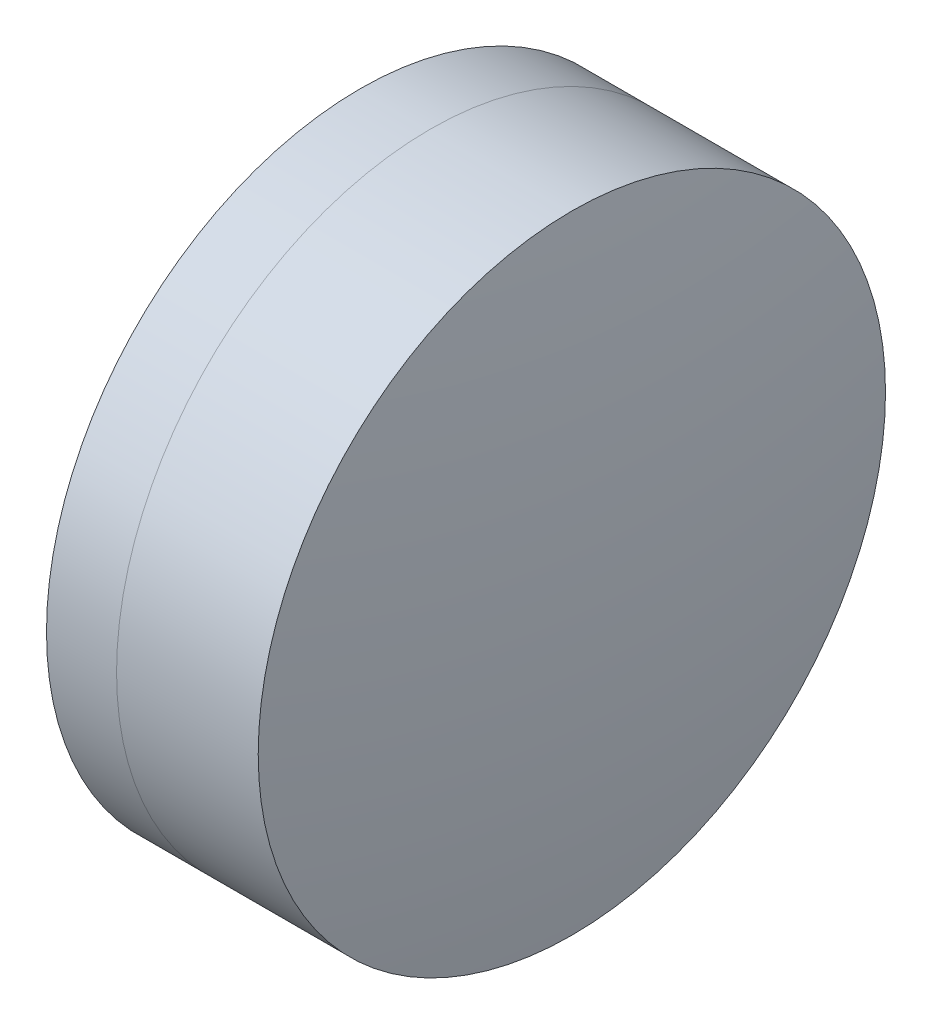
ISO-10303-21;
HEADER;
FILE_DESCRIPTION(('STEP AP214'),'2;1');
FILE_NAME('part.step','',(''),(''),'','','');
FILE_SCHEMA(('AUTOMOTIVE_DESIGN { 1 0 10303 214 1 1 1 1 }'));
ENDSEC;
DATA;
#1=APPLICATION_CONTEXT('core data for automotive mechanical design processes');
#2=APPLICATION_PROTOCOL_DEFINITION('international standard','automotive_design',2000,#1);
#3=PRODUCT_CONTEXT('',#1,'mechanical');
#4=PRODUCT('Part','Part','',(#3));
#5=PRODUCT_RELATED_PRODUCT_CATEGORY('part','',(#4));
#6=PRODUCT_DEFINITION_FORMATION('','',#4);
#7=PRODUCT_DEFINITION_CONTEXT('part definition',#1,'design');
#8=PRODUCT_DEFINITION('design','',#6,#7);
#9=PRODUCT_DEFINITION_SHAPE('','',#8);
#10=(LENGTH_UNIT() NAMED_UNIT(*) SI_UNIT(.MILLI.,.METRE.));
#11=(NAMED_UNIT(*) PLANE_ANGLE_UNIT() SI_UNIT($,.RADIAN.));
#12=(NAMED_UNIT(*) SI_UNIT($,.STERADIAN.) SOLID_ANGLE_UNIT());
#13=UNCERTAINTY_MEASURE_WITH_UNIT(LENGTH_MEASURE(1.E-05),#10,'distance_accuracy_value','');
#14=(GEOMETRIC_REPRESENTATION_CONTEXT(3) GLOBAL_UNCERTAINTY_ASSIGNED_CONTEXT((#13)) GLOBAL_UNIT_ASSIGNED_CONTEXT((#10,
#11,#12)) REPRESENTATION_CONTEXT('',''));
#15=CARTESIAN_POINT('',(0.,0.,0.));
#16=DIRECTION('',(0.,0.,1.));
#17=DIRECTION('',(1.,0.,0.));
#18=AXIS2_PLACEMENT_3D('',#15,#16,#17);
#19=CARTESIAN_POINT('',(-6.63942932123091,0.,0.));
#20=DIRECTION('',(-1.,0.,0.));
#21=DIRECTION('',(0.,0.,1.));
#22=AXIS2_PLACEMENT_3D('',#19,#20,#21);
#23=SPHERICAL_SURFACE('',#22,11.505);
#24=CARTESIAN_POINT('',(3.72228023848943,0.,0.));
#25=DIRECTION('',(-1.,0.,0.));
#26=DIRECTION('',(0.,0.,1.));
#27=AXIS2_PLACEMENT_3D('',#24,#25,#26);
#28=CIRCLE('',#27,5.);
#29=CARTESIAN_POINT('',(3.72228023848943,0.,5.));
#30=VERTEX_POINT('',#29);
#31=EDGE_CURVE('E11',#30,#30,#28,.T.);
#32=ORIENTED_EDGE('',*,*,#31,.T.);
#33=EDGE_LOOP('',(#32));
#34=FACE_BOUND('',#33,.T.);
#35=ADVANCED_FACE('F45',(#34),#23,.F.);
#36=CARTESIAN_POINT('',(-0.551919992657797,0.,0.));
#37=DIRECTION('',(-1.,0.,0.));
#38=DIRECTION('',(0.,0.,1.));
#39=AXIS2_PLACEMENT_3D('',#36,#37,#38);
#40=CYLINDRICAL_SURFACE('',#39,5.);
#41=CARTESIAN_POINT('',(5.98046290260198,0.,0.));
#42=DIRECTION('',(-1.,0.,0.));
#43=DIRECTION('',(0.,0.,1.));
#44=AXIS2_PLACEMENT_3D('',#41,#42,#43);
#45=CIRCLE('',#44,5.);
#46=CARTESIAN_POINT('',(5.98046290260198,0.,5.));
#47=VERTEX_POINT('',#46);
#48=EDGE_CURVE('E51',#47,#47,#45,.T.);
#49=ORIENTED_EDGE('',*,*,#48,.T.);
#50=EDGE_LOOP('',(#49));
#51=FACE_BOUND('',#50,.T.);
#52=ORIENTED_EDGE('',*,*,#31,.F.);
#53=EDGE_LOOP('',(#52));
#54=FACE_BOUND('',#53,.T.);
#55=ADVANCED_FACE('F57',(#51,#54),#40,.T.);
#56=CARTESIAN_POINT('',(-26.2854293212309,0.,0.));
#57=DIRECTION('',(-1.,0.,0.));
#58=DIRECTION('',(0.,0.,1.));
#59=AXIS2_PLACEMENT_3D('',#56,#57,#58);
#60=SPHERICAL_SURFACE('',#59,32.651);
#61=ORIENTED_EDGE('',*,*,#48,.F.);
#62=EDGE_LOOP('',(#61));
#63=FACE_BOUND('',#62,.T.);
#64=ADVANCED_FACE('F60',(#63),#60,.T.);
#65=CLOSED_SHELL('',(#35,#55,#64));
#66=MANIFOLD_SOLID_BREP('B2',#65);
#67=CARTESIAN_POINT('',(18.0375706787691,0.,0.));
#68=DIRECTION('',(-1.,0.,0.));
#69=DIRECTION('',(0.,0.,1.));
#70=AXIS2_PLACEMENT_3D('',#67,#68,#69);
#71=SPHERICAL_SURFACE('',#70,16.222);
#72=CARTESIAN_POINT('',(2.6053548948967,0.,0.));
#73=DIRECTION('',(-1.,0.,0.));
#74=DIRECTION('',(0.,0.,1.));
#75=AXIS2_PLACEMENT_3D('',#72,#73,#74);
#76=CIRCLE('',#75,5.);
#77=CARTESIAN_POINT('',(2.6053548948967,0.,5.));
#78=VERTEX_POINT('',#77);
#79=EDGE_CURVE('E44',#78,#78,#76,.T.);
#80=ORIENTED_EDGE('',*,*,#79,.T.);
#81=EDGE_LOOP('',(#80));
#82=FACE_BOUND('',#81,.T.);
#83=ADVANCED_FACE('F86',(#82),#71,.T.);
#84=CARTESIAN_POINT('',(-9.70261217833668,0.,0.));
#85=DIRECTION('',(-1.,0.,0.));
#86=DIRECTION('',(0.,0.,1.));
#87=AXIS2_PLACEMENT_3D('',#84,#85,#86);
#88=CYLINDRICAL_SURFACE('',#87,5.);
#89=CARTESIAN_POINT('',(3.72228023848943,0.,0.));
#90=DIRECTION('',(-1.,0.,0.));
#91=DIRECTION('',(0.,0.,1.));
#92=AXIS2_PLACEMENT_3D('',#89,#90,#91);
#93=CIRCLE('',#92,5.);
#94=CARTESIAN_POINT('',(3.72228023848943,0.,5.));
#95=VERTEX_POINT('',#94);
#96=EDGE_CURVE('E92',#95,#95,#93,.T.);
#97=ORIENTED_EDGE('',*,*,#96,.T.);
#98=EDGE_LOOP('',(#97));
#99=FACE_BOUND('',#98,.T.);
#100=ORIENTED_EDGE('',*,*,#79,.F.);
#101=EDGE_LOOP('',(#100));
#102=FACE_BOUND('',#101,.T.);
#103=ADVANCED_FACE('F98',(#99,#102),#88,.T.);
#104=CARTESIAN_POINT('',(-6.63942932123091,0.,0.));
#105=DIRECTION('',(-1.,0.,0.));
#106=DIRECTION('',(0.,0.,1.));
#107=AXIS2_PLACEMENT_3D('',#104,#105,#106);
#108=SPHERICAL_SURFACE('',#107,11.505);
#109=ORIENTED_EDGE('',*,*,#96,.F.);
#110=EDGE_LOOP('',(#109));
#111=FACE_BOUND('',#110,.T.);
#112=ADVANCED_FACE('F101',(#111),#108,.T.);
#113=CLOSED_SHELL('',(#83,#103,#112));
#114=MANIFOLD_SOLID_BREP('B6',#113);
#115=ADVANCED_BREP_SHAPE_REPRESENTATION('',(#18,#66,#114),#14);
#116=SHAPE_DEFINITION_REPRESENTATION(#9,#115);
ENDSEC;
END-ISO-10303-21;
